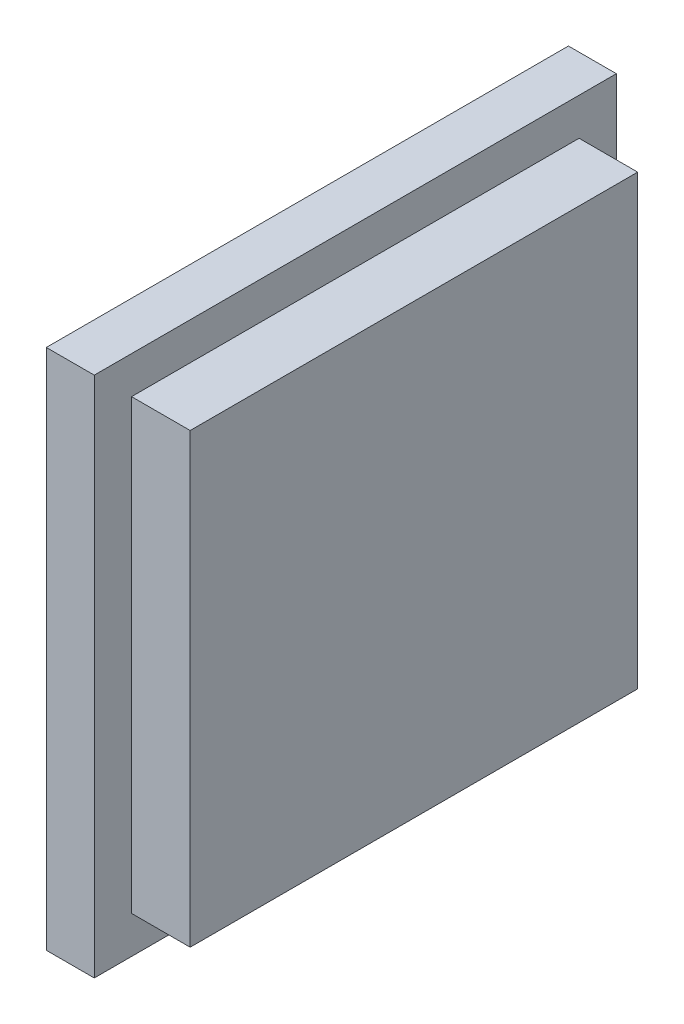
ISO-10303-21;
HEADER;
FILE_DESCRIPTION(('STEP AP214'),'2;1');
FILE_NAME('part.step','',(''),(''),'','','');
FILE_SCHEMA(('AUTOMOTIVE_DESIGN { 1 0 10303 214 1 1 1 1 }'));
ENDSEC;
DATA;
#1=APPLICATION_CONTEXT('core data for automotive mechanical design processes');
#2=APPLICATION_PROTOCOL_DEFINITION('international standard','automotive_design',2000,#1);
#3=PRODUCT_CONTEXT('',#1,'mechanical');
#4=PRODUCT('Part','Part','',(#3));
#5=PRODUCT_RELATED_PRODUCT_CATEGORY('part','',(#4));
#6=PRODUCT_DEFINITION_FORMATION('','',#4);
#7=PRODUCT_DEFINITION_CONTEXT('part definition',#1,'design');
#8=PRODUCT_DEFINITION('design','',#6,#7);
#9=PRODUCT_DEFINITION_SHAPE('','',#8);
#10=(LENGTH_UNIT() NAMED_UNIT(*) SI_UNIT(.MILLI.,.METRE.));
#11=(NAMED_UNIT(*) PLANE_ANGLE_UNIT() SI_UNIT($,.RADIAN.));
#12=(NAMED_UNIT(*) SI_UNIT($,.STERADIAN.) SOLID_ANGLE_UNIT());
#13=UNCERTAINTY_MEASURE_WITH_UNIT(LENGTH_MEASURE(1.E-05),#10,'distance_accuracy_value','');
#14=(GEOMETRIC_REPRESENTATION_CONTEXT(3) GLOBAL_UNCERTAINTY_ASSIGNED_CONTEXT((#13)) GLOBAL_UNIT_ASSIGNED_CONTEXT((#10,
#11,#12)) REPRESENTATION_CONTEXT('',''));
#15=CARTESIAN_POINT('',(0.,0.,0.));
#16=DIRECTION('',(0.,0.,1.));
#17=DIRECTION('',(1.,0.,0.));
#18=AXIS2_PLACEMENT_3D('',#15,#16,#17);
#19=CARTESIAN_POINT('',(4.5,0.,0.));
#20=DIRECTION('',(-1.,0.,0.));
#21=DIRECTION('',(0.,0.,1.));
#22=AXIS2_PLACEMENT_3D('',#19,#20,#21);
#23=PLANE('',#22);
#24=DIRECTION('',(0.,-1.,0.));
#25=VECTOR('',#24,1.);
#26=CARTESIAN_POINT('',(4.5,24.5,24.5));
#27=LINE('',#26,#25);
#28=CARTESIAN_POINT('',(4.5,24.5,24.5));
#29=VERTEX_POINT('',#28);
#30=CARTESIAN_POINT('',(4.5,-24.5,24.5));
#31=VERTEX_POINT('',#30);
#32=EDGE_CURVE('E127',#29,#31,#27,.T.);
#33=ORIENTED_EDGE('',*,*,#32,.T.);
#34=DIRECTION('',(0.,0.,-1.));
#35=VECTOR('',#34,1.);
#36=CARTESIAN_POINT('',(4.5,-24.5,-24.5));
#37=LINE('',#36,#35);
#38=CARTESIAN_POINT('',(4.5,-24.5,-24.5));
#39=VERTEX_POINT('',#38);
#40=EDGE_CURVE('E130',#31,#39,#37,.T.);
#41=ORIENTED_EDGE('',*,*,#40,.T.);
#42=DIRECTION('',(0.,1.,0.));
#43=VECTOR('',#42,1.);
#44=CARTESIAN_POINT('',(4.5,24.5,-24.5));
#45=LINE('',#44,#43);
#46=CARTESIAN_POINT('',(4.5,24.5,-24.5));
#47=VERTEX_POINT('',#46);
#48=EDGE_CURVE('E133',#39,#47,#45,.T.);
#49=ORIENTED_EDGE('',*,*,#48,.T.);
#50=DIRECTION('',(0.,0.,1.));
#51=VECTOR('',#50,1.);
#52=CARTESIAN_POINT('',(4.5,24.5,-24.5));
#53=LINE('',#52,#51);
#54=EDGE_CURVE('E135',#47,#29,#53,.T.);
#55=ORIENTED_EDGE('',*,*,#54,.T.);
#56=EDGE_LOOP('',(#33,#41,#49,#55));
#57=FACE_BOUND('',#56,.T.);
#58=DIRECTION('',(0.,1.,0.));
#59=VECTOR('',#58,1.);
#60=CARTESIAN_POINT('',(4.5,21.,-21.));
#61=LINE('',#60,#59);
#62=CARTESIAN_POINT('',(4.5,-21.,-21.));
#63=VERTEX_POINT('',#62);
#64=CARTESIAN_POINT('',(4.5,21.,-21.));
#65=VERTEX_POINT('',#64);
#66=EDGE_CURVE('E117',#63,#65,#61,.T.);
#67=ORIENTED_EDGE('',*,*,#66,.F.);
#68=DIRECTION('',(0.,0.,-1.));
#69=VECTOR('',#68,1.);
#70=CARTESIAN_POINT('',(4.5,-21.,21.));
#71=LINE('',#70,#69);
#72=CARTESIAN_POINT('',(4.5,-21.,21.));
#73=VERTEX_POINT('',#72);
#74=EDGE_CURVE('E114',#73,#63,#71,.T.);
#75=ORIENTED_EDGE('',*,*,#74,.F.);
#76=DIRECTION('',(0.,-1.,0.));
#77=VECTOR('',#76,1.);
#78=CARTESIAN_POINT('',(4.5,21.,21.));
#79=LINE('',#78,#77);
#80=CARTESIAN_POINT('',(4.5,21.,21.));
#81=VERTEX_POINT('',#80);
#82=EDGE_CURVE('E52',#81,#73,#79,.T.);
#83=ORIENTED_EDGE('',*,*,#82,.F.);
#84=DIRECTION('',(0.,0.,1.));
#85=VECTOR('',#84,1.);
#86=CARTESIAN_POINT('',(4.5,21.,21.));
#87=LINE('',#86,#85);
#88=EDGE_CURVE('E47',#65,#81,#87,.T.);
#89=ORIENTED_EDGE('',*,*,#88,.F.);
#90=EDGE_LOOP('',(#67,#75,#83,#89));
#91=FACE_BOUND('',#90,.T.);
#92=ADVANCED_FACE('F32',(#57,#91),#23,.F.);
#93=CARTESIAN_POINT('',(4.5,24.5,24.5));
#94=DIRECTION('',(0.,0.,-1.));
#95=DIRECTION('',(0.,1.,0.));
#96=AXIS2_PLACEMENT_3D('',#93,#94,#95);
#97=PLANE('',#96);
#98=DIRECTION('',(0.,-1.,0.));
#99=VECTOR('',#98,1.);
#100=CARTESIAN_POINT('',(0.,24.5,24.5));
#101=LINE('',#100,#99);
#102=CARTESIAN_POINT('',(0.,24.5,24.5));
#103=VERTEX_POINT('',#102);
#104=CARTESIAN_POINT('',(0.,-24.5,24.5));
#105=VERTEX_POINT('',#104);
#106=EDGE_CURVE('E118',#103,#105,#101,.T.);
#107=ORIENTED_EDGE('',*,*,#106,.T.);
#108=DIRECTION('',(-1.,0.,0.));
#109=VECTOR('',#108,1.);
#110=CARTESIAN_POINT('',(4.5,-24.5,24.5));
#111=LINE('',#110,#109);
#112=EDGE_CURVE('E11',#31,#105,#111,.T.);
#113=ORIENTED_EDGE('',*,*,#112,.F.);
#114=ORIENTED_EDGE('',*,*,#32,.F.);
#115=DIRECTION('',(-1.,0.,0.));
#116=VECTOR('',#115,1.);
#117=CARTESIAN_POINT('',(4.5,24.5,24.5));
#118=LINE('',#117,#116);
#119=EDGE_CURVE('E136',#29,#103,#118,.T.);
#120=ORIENTED_EDGE('',*,*,#119,.T.);
#121=EDGE_LOOP('',(#107,#113,#114,#120));
#122=FACE_BOUND('',#121,.T.);
#123=ADVANCED_FACE('F34',(#122),#97,.F.);
#124=CARTESIAN_POINT('',(4.5,-24.5,-24.5));
#125=DIRECTION('',(0.,1.,0.));
#126=DIRECTION('',(0.,0.,1.));
#127=AXIS2_PLACEMENT_3D('',#124,#125,#126);
#128=PLANE('',#127);
#129=DIRECTION('',(0.,0.,-1.));
#130=VECTOR('',#129,1.);
#131=CARTESIAN_POINT('',(0.,-24.5,-24.5));
#132=LINE('',#131,#130);
#133=CARTESIAN_POINT('',(0.,-24.5,-24.5));
#134=VERTEX_POINT('',#133);
#135=EDGE_CURVE('E121',#105,#134,#132,.T.);
#136=ORIENTED_EDGE('',*,*,#135,.T.);
#137=DIRECTION('',(-1.,0.,0.));
#138=VECTOR('',#137,1.);
#139=CARTESIAN_POINT('',(4.5,-24.5,-24.5));
#140=LINE('',#139,#138);
#141=EDGE_CURVE('E40',#39,#134,#140,.T.);
#142=ORIENTED_EDGE('',*,*,#141,.F.);
#143=ORIENTED_EDGE('',*,*,#40,.F.);
#144=ORIENTED_EDGE('',*,*,#112,.T.);
#145=EDGE_LOOP('',(#136,#142,#143,#144));
#146=FACE_BOUND('',#145,.T.);
#147=ADVANCED_FACE('F166',(#146),#128,.F.);
#148=CARTESIAN_POINT('',(4.5,24.5,-24.5));
#149=DIRECTION('',(0.,0.,1.));
#150=DIRECTION('',(0.,-1.,0.));
#151=AXIS2_PLACEMENT_3D('',#148,#149,#150);
#152=PLANE('',#151);
#153=DIRECTION('',(0.,1.,0.));
#154=VECTOR('',#153,1.);
#155=CARTESIAN_POINT('',(0.,24.5,-24.5));
#156=LINE('',#155,#154);
#157=CARTESIAN_POINT('',(0.,24.5,-24.5));
#158=VERTEX_POINT('',#157);
#159=EDGE_CURVE('E139',#134,#158,#156,.T.);
#160=ORIENTED_EDGE('',*,*,#159,.T.);
#161=DIRECTION('',(-1.,0.,0.));
#162=VECTOR('',#161,1.);
#163=CARTESIAN_POINT('',(4.5,24.5,-24.5));
#164=LINE('',#163,#162);
#165=EDGE_CURVE('E144',#47,#158,#164,.T.);
#166=ORIENTED_EDGE('',*,*,#165,.F.);
#167=ORIENTED_EDGE('',*,*,#48,.F.);
#168=ORIENTED_EDGE('',*,*,#141,.T.);
#169=EDGE_LOOP('',(#160,#166,#167,#168));
#170=FACE_BOUND('',#169,.T.);
#171=ADVANCED_FACE('F151',(#170),#152,.F.);
#172=CARTESIAN_POINT('',(4.5,24.5,-24.5));
#173=DIRECTION('',(0.,-1.,0.));
#174=DIRECTION('',(0.,0.,-1.));
#175=AXIS2_PLACEMENT_3D('',#172,#173,#174);
#176=PLANE('',#175);
#177=DIRECTION('',(0.,0.,1.));
#178=VECTOR('',#177,1.);
#179=CARTESIAN_POINT('',(0.,24.5,-24.5));
#180=LINE('',#179,#178);
#181=EDGE_CURVE('E131',#158,#103,#180,.T.);
#182=ORIENTED_EDGE('',*,*,#181,.T.);
#183=ORIENTED_EDGE('',*,*,#119,.F.);
#184=ORIENTED_EDGE('',*,*,#54,.F.);
#185=ORIENTED_EDGE('',*,*,#165,.T.);
#186=EDGE_LOOP('',(#182,#183,#184,#185));
#187=FACE_BOUND('',#186,.T.);
#188=ADVANCED_FACE('F160',(#187),#176,.F.);
#189=CARTESIAN_POINT('',(0.,0.,0.));
#190=DIRECTION('',(-1.,0.,0.));
#191=DIRECTION('',(0.,0.,1.));
#192=AXIS2_PLACEMENT_3D('',#189,#190,#191);
#193=PLANE('',#192);
#194=ORIENTED_EDGE('',*,*,#106,.F.);
#195=ORIENTED_EDGE('',*,*,#181,.F.);
#196=ORIENTED_EDGE('',*,*,#159,.F.);
#197=ORIENTED_EDGE('',*,*,#135,.F.);
#198=EDGE_LOOP('',(#194,#195,#196,#197));
#199=FACE_BOUND('',#198,.T.);
#200=ADVANCED_FACE('F157',(#199),#193,.T.);
#201=CARTESIAN_POINT('',(10.,21.,-21.));
#202=DIRECTION('',(0.,0.,1.));
#203=DIRECTION('',(1.,0.,0.));
#204=AXIS2_PLACEMENT_3D('',#201,#202,#203);
#205=PLANE('',#204);
#206=ORIENTED_EDGE('',*,*,#66,.T.);
#207=DIRECTION('',(-1.,0.,0.));
#208=VECTOR('',#207,1.);
#209=CARTESIAN_POINT('',(10.,21.,-21.));
#210=LINE('',#209,#208);
#211=CARTESIAN_POINT('',(10.,21.,-21.));
#212=VERTEX_POINT('',#211);
#213=EDGE_CURVE('E98',#212,#65,#210,.T.);
#214=ORIENTED_EDGE('',*,*,#213,.F.);
#215=DIRECTION('',(0.,1.,0.));
#216=VECTOR('',#215,1.);
#217=CARTESIAN_POINT('',(10.,21.,-21.));
#218=LINE('',#217,#216);
#219=CARTESIAN_POINT('',(10.,-21.,-21.));
#220=VERTEX_POINT('',#219);
#221=EDGE_CURVE('E105',#220,#212,#218,.T.);
#222=ORIENTED_EDGE('',*,*,#221,.F.);
#223=DIRECTION('',(-1.,0.,0.));
#224=VECTOR('',#223,1.);
#225=CARTESIAN_POINT('',(10.,-21.,-21.));
#226=LINE('',#225,#224);
#227=EDGE_CURVE('E259',#220,#63,#226,.T.);
#228=ORIENTED_EDGE('',*,*,#227,.T.);
#229=EDGE_LOOP('',(#206,#214,#222,#228));
#230=FACE_BOUND('',#229,.T.);
#231=ADVANCED_FACE('F116',(#230),#205,.F.);
#232=CARTESIAN_POINT('',(10.,21.,21.));
#233=DIRECTION('',(0.,-1.,0.));
#234=DIRECTION('',(0.,0.,-1.));
#235=AXIS2_PLACEMENT_3D('',#232,#233,#234);
#236=PLANE('',#235);
#237=ORIENTED_EDGE('',*,*,#88,.T.);
#238=DIRECTION('',(-1.,0.,0.));
#239=VECTOR('',#238,1.);
#240=CARTESIAN_POINT('',(10.,21.,21.));
#241=LINE('',#240,#239);
#242=CARTESIAN_POINT('',(10.,21.,21.));
#243=VERTEX_POINT('',#242);
#244=EDGE_CURVE('E101',#243,#81,#241,.T.);
#245=ORIENTED_EDGE('',*,*,#244,.F.);
#246=DIRECTION('',(0.,0.,1.));
#247=VECTOR('',#246,1.);
#248=CARTESIAN_POINT('',(10.,21.,21.));
#249=LINE('',#248,#247);
#250=EDGE_CURVE('E94',#212,#243,#249,.T.);
#251=ORIENTED_EDGE('',*,*,#250,.F.);
#252=ORIENTED_EDGE('',*,*,#213,.T.);
#253=EDGE_LOOP('',(#237,#245,#251,#252));
#254=FACE_BOUND('',#253,.T.);
#255=ADVANCED_FACE('F96',(#254),#236,.F.);
#256=CARTESIAN_POINT('',(10.,21.,21.));
#257=DIRECTION('',(0.,0.,-1.));
#258=DIRECTION('',(-1.,0.,0.));
#259=AXIS2_PLACEMENT_3D('',#256,#257,#258);
#260=PLANE('',#259);
#261=ORIENTED_EDGE('',*,*,#82,.T.);
#262=DIRECTION('',(-1.,0.,0.));
#263=VECTOR('',#262,1.);
#264=CARTESIAN_POINT('',(10.,-21.,21.));
#265=LINE('',#264,#263);
#266=CARTESIAN_POINT('',(10.,-21.,21.));
#267=VERTEX_POINT('',#266);
#268=EDGE_CURVE('E123',#267,#73,#265,.T.);
#269=ORIENTED_EDGE('',*,*,#268,.F.);
#270=DIRECTION('',(0.,-1.,0.));
#271=VECTOR('',#270,1.);
#272=CARTESIAN_POINT('',(10.,21.,21.));
#273=LINE('',#272,#271);
#274=EDGE_CURVE('E104',#243,#267,#273,.T.);
#275=ORIENTED_EDGE('',*,*,#274,.F.);
#276=ORIENTED_EDGE('',*,*,#244,.T.);
#277=EDGE_LOOP('',(#261,#269,#275,#276));
#278=FACE_BOUND('',#277,.T.);
#279=ADVANCED_FACE('F202',(#278),#260,.F.);
#280=CARTESIAN_POINT('',(10.,-21.,21.));
#281=DIRECTION('',(0.,1.,0.));
#282=DIRECTION('',(0.,0.,1.));
#283=AXIS2_PLACEMENT_3D('',#280,#281,#282);
#284=PLANE('',#283);
#285=ORIENTED_EDGE('',*,*,#74,.T.);
#286=ORIENTED_EDGE('',*,*,#227,.F.);
#287=DIRECTION('',(0.,0.,-1.));
#288=VECTOR('',#287,1.);
#289=CARTESIAN_POINT('',(10.,-21.,21.));
#290=LINE('',#289,#288);
#291=EDGE_CURVE('E110',#267,#220,#290,.T.);
#292=ORIENTED_EDGE('',*,*,#291,.F.);
#293=ORIENTED_EDGE('',*,*,#268,.T.);
#294=EDGE_LOOP('',(#285,#286,#292,#293));
#295=FACE_BOUND('',#294,.T.);
#296=ADVANCED_FACE('F208',(#295),#284,.F.);
#297=CARTESIAN_POINT('',(10.,0.,0.));
#298=DIRECTION('',(1.,0.,0.));
#299=DIRECTION('',(0.,0.,-1.));
#300=AXIS2_PLACEMENT_3D('',#297,#298,#299);
#301=PLANE('',#300);
#302=ORIENTED_EDGE('',*,*,#221,.T.);
#303=ORIENTED_EDGE('',*,*,#250,.T.);
#304=ORIENTED_EDGE('',*,*,#274,.T.);
#305=ORIENTED_EDGE('',*,*,#291,.T.);
#306=EDGE_LOOP('',(#302,#303,#304,#305));
#307=FACE_BOUND('',#306,.T.);
#308=ADVANCED_FACE('F108',(#307),#301,.T.);
#309=CLOSED_SHELL('',(#92,#123,#147,#171,#188,#200,#231,#255,#279,#296,#308));
#310=MANIFOLD_SOLID_BREP('B2',#309);
#311=ADVANCED_BREP_SHAPE_REPRESENTATION('',(#18,#310),#14);
#312=SHAPE_DEFINITION_REPRESENTATION(#9,#311);
ENDSEC;
END-ISO-10303-21;
